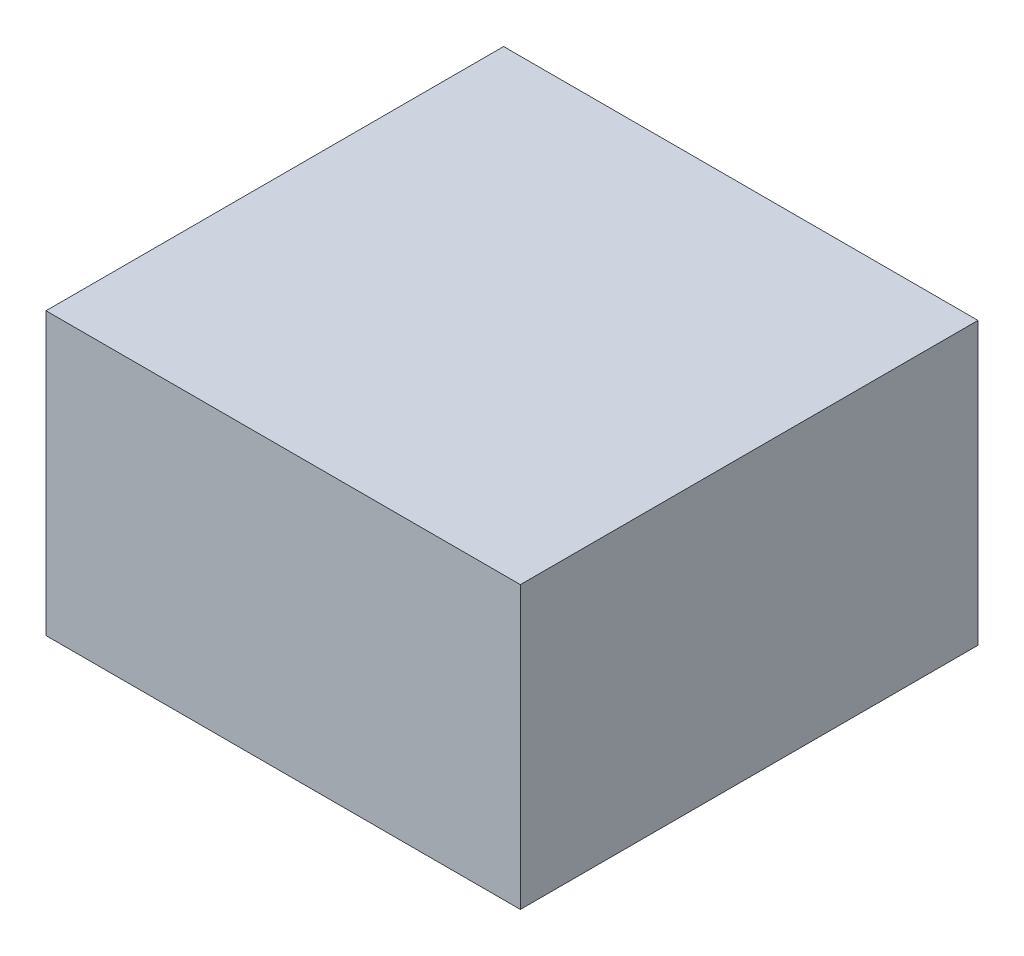
ISO-10303-21;
HEADER;
FILE_DESCRIPTION(('STEP AP214'),'2;1');
FILE_NAME('part.step','',(''),(''),'','','');
FILE_SCHEMA(('AUTOMOTIVE_DESIGN { 1 0 10303 214 1 1 1 1 }'));
ENDSEC;
DATA;
#1=APPLICATION_CONTEXT('core data for automotive mechanical design processes');
#2=APPLICATION_PROTOCOL_DEFINITION('international standard','automotive_design',2000,#1);
#3=PRODUCT_CONTEXT('',#1,'mechanical');
#4=PRODUCT('Part','Part','',(#3));
#5=PRODUCT_RELATED_PRODUCT_CATEGORY('part','',(#4));
#6=PRODUCT_DEFINITION_FORMATION('','',#4);
#7=PRODUCT_DEFINITION_CONTEXT('part definition',#1,'design');
#8=PRODUCT_DEFINITION('design','',#6,#7);
#9=PRODUCT_DEFINITION_SHAPE('','',#8);
#10=(LENGTH_UNIT() NAMED_UNIT(*) SI_UNIT(.MILLI.,.METRE.));
#11=(NAMED_UNIT(*) PLANE_ANGLE_UNIT() SI_UNIT($,.RADIAN.));
#12=(NAMED_UNIT(*) SI_UNIT($,.STERADIAN.) SOLID_ANGLE_UNIT());
#13=UNCERTAINTY_MEASURE_WITH_UNIT(LENGTH_MEASURE(1.E-05),#10,'distance_accuracy_value','');
#14=(GEOMETRIC_REPRESENTATION_CONTEXT(3) GLOBAL_UNCERTAINTY_ASSIGNED_CONTEXT((#13)) GLOBAL_UNIT_ASSIGNED_CONTEXT((#10,
#11,#12)) REPRESENTATION_CONTEXT('',''));
#15=CARTESIAN_POINT('',(0.,0.,0.));
#16=DIRECTION('',(0.,0.,1.));
#17=DIRECTION('',(1.,0.,0.));
#18=AXIS2_PLACEMENT_3D('',#15,#16,#17);
#19=CARTESIAN_POINT('',(-212.5,3.175,-205.));
#20=DIRECTION('',(1.,0.,0.));
#21=DIRECTION('',(0.,0.,-1.));
#22=AXIS2_PLACEMENT_3D('',#19,#20,#21);
#23=PLANE('',#22);
#24=DIRECTION('',(0.,-1.,0.));
#25=VECTOR('',#24,1.);
#26=CARTESIAN_POINT('',(-212.5,3.17500000000004,73.4000000000001));
#27=LINE('',#26,#25);
#28=CARTESIAN_POINT('',(-212.5,232.061,73.4));
#29=VERTEX_POINT('',#28);
#30=CARTESIAN_POINT('',(-212.5,132.061,73.4));
#31=VERTEX_POINT('',#30);
#32=EDGE_CURVE('E467',#29,#31,#27,.T.);
#33=ORIENTED_EDGE('',*,*,#32,.F.);
#34=DIRECTION('',(0.,0.,-1.));
#35=VECTOR('',#34,1.);
#36=CARTESIAN_POINT('',(-212.5,232.061,-205.));
#37=LINE('',#36,#35);
#38=CARTESIAN_POINT('',(-212.5,232.061,135.4));
#39=VERTEX_POINT('',#38);
#40=EDGE_CURVE('E457',#39,#29,#37,.T.);
#41=ORIENTED_EDGE('',*,*,#40,.F.);
#42=DIRECTION('',(0.,1.,0.));
#43=VECTOR('',#42,1.);
#44=CARTESIAN_POINT('',(-212.5,3.175,135.4));
#45=LINE('',#44,#43);
#46=CARTESIAN_POINT('',(-212.5,132.061,135.4));
#47=VERTEX_POINT('',#46);
#48=EDGE_CURVE('E461',#47,#39,#45,.T.);
#49=ORIENTED_EDGE('',*,*,#48,.F.);
#50=DIRECTION('',(0.,0.,1.));
#51=VECTOR('',#50,1.);
#52=CARTESIAN_POINT('',(-212.5,132.061,-205.));
#53=LINE('',#52,#51);
#54=EDGE_CURVE('E464',#31,#47,#53,.T.);
#55=ORIENTED_EDGE('',*,*,#54,.F.);
#56=EDGE_LOOP('',(#33,#41,#49,#55));
#57=FACE_BOUND('',#56,.T.);
#58=DIRECTION('',(0.,-1.,0.));
#59=VECTOR('',#58,1.);
#60=CARTESIAN_POINT('',(-212.5,3.17500000000002,-65.7999999999999));
#61=LINE('',#60,#59);
#62=CARTESIAN_POINT('',(-212.5,232.061,-65.8));
#63=VERTEX_POINT('',#62);
#64=CARTESIAN_POINT('',(-212.5,132.061,-65.8));
#65=VERTEX_POINT('',#64);
#66=EDGE_CURVE('E441',#63,#65,#61,.T.);
#67=ORIENTED_EDGE('',*,*,#66,.F.);
#68=DIRECTION('',(0.,0.,-1.));
#69=VECTOR('',#68,1.);
#70=CARTESIAN_POINT('',(-212.5,232.061,-205.));
#71=LINE('',#70,#69);
#72=CARTESIAN_POINT('',(-212.5,232.061,-3.79999999999994));
#73=VERTEX_POINT('',#72);
#74=EDGE_CURVE('E431',#73,#63,#71,.T.);
#75=ORIENTED_EDGE('',*,*,#74,.F.);
#76=DIRECTION('',(0.,1.,0.));
#77=VECTOR('',#76,1.);
#78=CARTESIAN_POINT('',(-212.5,3.17500000000002,-3.79999999999991));
#79=LINE('',#78,#77);
#80=CARTESIAN_POINT('',(-212.5,132.061,-3.79999999999993));
#81=VERTEX_POINT('',#80);
#82=EDGE_CURVE('E435',#81,#73,#79,.T.);
#83=ORIENTED_EDGE('',*,*,#82,.F.);
#84=DIRECTION('',(0.,0.,1.));
#85=VECTOR('',#84,1.);
#86=CARTESIAN_POINT('',(-212.5,132.061,-205.));
#87=LINE('',#86,#85);
#88=EDGE_CURVE('E438',#65,#81,#87,.T.);
#89=ORIENTED_EDGE('',*,*,#88,.F.);
#90=EDGE_LOOP('',(#67,#75,#83,#89));
#91=FACE_BOUND('',#90,.T.);
#92=DIRECTION('',(0.,-1.,0.));
#93=VECTOR('',#92,1.);
#94=CARTESIAN_POINT('',(-212.5,3.175,-135.4));
#95=LINE('',#94,#93);
#96=CARTESIAN_POINT('',(-212.5,232.061,-135.4));
#97=VERTEX_POINT('',#96);
#98=CARTESIAN_POINT('',(-212.5,132.061,-135.4));
#99=VERTEX_POINT('',#98);
#100=EDGE_CURVE('E428',#97,#99,#95,.T.);
#101=ORIENTED_EDGE('',*,*,#100,.F.);
#102=DIRECTION('',(0.,0.,-1.));
#103=VECTOR('',#102,1.);
#104=CARTESIAN_POINT('',(-212.5,232.061,-205.));
#105=LINE('',#104,#103);
#106=CARTESIAN_POINT('',(-212.5,232.061,-73.3999999999999));
#107=VERTEX_POINT('',#106);
#108=EDGE_CURVE('E418',#107,#97,#105,.T.);
#109=ORIENTED_EDGE('',*,*,#108,.F.);
#110=DIRECTION('',(0.,1.,0.));
#111=VECTOR('',#110,1.);
#112=CARTESIAN_POINT('',(-212.5,3.17500000000002,-73.3999999999999));
#113=LINE('',#112,#111);
#114=CARTESIAN_POINT('',(-212.5,132.061,-73.3999999999999));
#115=VERTEX_POINT('',#114);
#116=EDGE_CURVE('E422',#115,#107,#113,.T.);
#117=ORIENTED_EDGE('',*,*,#116,.F.);
#118=DIRECTION('',(0.,0.,1.));
#119=VECTOR('',#118,1.);
#120=CARTESIAN_POINT('',(-212.5,132.061,-205.));
#121=LINE('',#120,#119);
#122=EDGE_CURVE('E425',#99,#115,#121,.T.);
#123=ORIENTED_EDGE('',*,*,#122,.F.);
#124=EDGE_LOOP('',(#101,#109,#117,#123));
#125=FACE_BOUND('',#124,.T.);
#126=DIRECTION('',(0.,-1.,0.));
#127=VECTOR('',#126,1.);
#128=CARTESIAN_POINT('',(-212.5,3.17500000000003,3.80000000000008));
#129=LINE('',#128,#127);
#130=CARTESIAN_POINT('',(-212.5,232.061,3.8));
#131=VERTEX_POINT('',#130);
#132=CARTESIAN_POINT('',(-212.5,132.061,3.80000000000003));
#133=VERTEX_POINT('',#132);
#134=EDGE_CURVE('E454',#131,#133,#129,.T.);
#135=ORIENTED_EDGE('',*,*,#134,.F.);
#136=DIRECTION('',(0.,0.,-1.));
#137=VECTOR('',#136,1.);
#138=CARTESIAN_POINT('',(-212.5,232.061,-205.));
#139=LINE('',#138,#137);
#140=CARTESIAN_POINT('',(-212.5,232.061,65.8000000000001));
#141=VERTEX_POINT('',#140);
#142=EDGE_CURVE('E444',#141,#131,#139,.T.);
#143=ORIENTED_EDGE('',*,*,#142,.F.);
#144=DIRECTION('',(0.,1.,0.));
#145=VECTOR('',#144,1.);
#146=CARTESIAN_POINT('',(-212.5,3.17500000000004,65.8000000000001));
#147=LINE('',#146,#145);
#148=CARTESIAN_POINT('',(-212.5,132.061,65.8000000000001));
#149=VERTEX_POINT('',#148);
#150=EDGE_CURVE('E448',#149,#141,#147,.T.);
#151=ORIENTED_EDGE('',*,*,#150,.F.);
#152=DIRECTION('',(0.,0.,1.));
#153=VECTOR('',#152,1.);
#154=CARTESIAN_POINT('',(-212.5,132.061,-205.));
#155=LINE('',#154,#153);
#156=EDGE_CURVE('E451',#133,#149,#155,.T.);
#157=ORIENTED_EDGE('',*,*,#156,.F.);
#158=EDGE_LOOP('',(#135,#143,#151,#157));
#159=FACE_BOUND('',#158,.T.);
#160=DIRECTION('',(0.,0.,1.));
#161=VECTOR('',#160,1.);
#162=CARTESIAN_POINT('',(-212.5,132.061,-205.));
#163=LINE('',#162,#161);
#164=CARTESIAN_POINT('',(-212.5,132.061,143.));
#165=VERTEX_POINT('',#164);
#166=CARTESIAN_POINT('',(-212.5,132.061,205.));
#167=VERTEX_POINT('',#166);
#168=EDGE_CURVE('E11',#165,#167,#163,.T.);
#169=ORIENTED_EDGE('',*,*,#168,.F.);
#170=DIRECTION('',(0.,-1.,0.));
#171=VECTOR('',#170,1.);
#172=CARTESIAN_POINT('',(-212.5,3.175,143.));
#173=LINE('',#172,#171);
#174=CARTESIAN_POINT('',(-212.5,232.061,143.));
#175=VERTEX_POINT('',#174);
#176=EDGE_CURVE('E49',#175,#165,#173,.T.);
#177=ORIENTED_EDGE('',*,*,#176,.F.);
#178=DIRECTION('',(0.,0.,-1.));
#179=VECTOR('',#178,1.);
#180=CARTESIAN_POINT('',(-212.5,232.061,-205.));
#181=LINE('',#180,#179);
#182=CARTESIAN_POINT('',(-212.5,232.061,205.));
#183=VERTEX_POINT('',#182);
#184=EDGE_CURVE('E470',#183,#175,#181,.T.);
#185=ORIENTED_EDGE('',*,*,#184,.F.);
#186=DIRECTION('',(0.,-1.,0.));
#187=VECTOR('',#186,1.);
#188=CARTESIAN_POINT('',(-212.5,3.175,205.));
#189=LINE('',#188,#187);
#190=CARTESIAN_POINT('',(-212.5,252.061,205.));
#191=VERTEX_POINT('',#190);
#192=EDGE_CURVE('E263',#191,#183,#189,.T.);
#193=ORIENTED_EDGE('',*,*,#192,.F.);
#194=DIRECTION('',(0.,0.,1.));
#195=VECTOR('',#194,1.);
#196=CARTESIAN_POINT('',(-212.5,252.061,-205.));
#197=LINE('',#196,#195);
#198=CARTESIAN_POINT('',(-212.5,252.061,-205.));
#199=VERTEX_POINT('',#198);
#200=EDGE_CURVE('E261',#199,#191,#197,.T.);
#201=ORIENTED_EDGE('',*,*,#200,.F.);
#202=DIRECTION('',(0.,-1.,0.));
#203=VECTOR('',#202,1.);
#204=CARTESIAN_POINT('',(-212.5,3.175,-205.));
#205=LINE('',#204,#203);
#206=CARTESIAN_POINT('',(-212.5,232.061,-205.));
#207=VERTEX_POINT('',#206);
#208=EDGE_CURVE('E246',#199,#207,#205,.T.);
#209=ORIENTED_EDGE('',*,*,#208,.T.);
#210=DIRECTION('',(0.,0.,-1.));
#211=VECTOR('',#210,1.);
#212=CARTESIAN_POINT('',(-212.5,232.061,-205.));
#213=LINE('',#212,#211);
#214=CARTESIAN_POINT('',(-212.5,232.061,-143.));
#215=VERTEX_POINT('',#214);
#216=EDGE_CURVE('E409',#215,#207,#213,.T.);
#217=ORIENTED_EDGE('',*,*,#216,.F.);
#218=DIRECTION('',(0.,1.,0.));
#219=VECTOR('',#218,1.);
#220=CARTESIAN_POINT('',(-212.5,3.17499999999998,-143.));
#221=LINE('',#220,#219);
#222=CARTESIAN_POINT('',(-212.5,132.061,-143.));
#223=VERTEX_POINT('',#222);
#224=EDGE_CURVE('E412',#223,#215,#221,.T.);
#225=ORIENTED_EDGE('',*,*,#224,.F.);
#226=DIRECTION('',(0.,0.,1.));
#227=VECTOR('',#226,1.);
#228=CARTESIAN_POINT('',(-212.5,132.061,-205.));
#229=LINE('',#228,#227);
#230=CARTESIAN_POINT('',(-212.5,132.061,-205.));
#231=VERTEX_POINT('',#230);
#232=EDGE_CURVE('E415',#231,#223,#229,.T.);
#233=ORIENTED_EDGE('',*,*,#232,.F.);
#234=CARTESIAN_POINT('',(-212.5,0.,-205.));
#235=VERTEX_POINT('',#234);
#236=EDGE_CURVE('E259',#231,#235,#205,.T.);
#237=ORIENTED_EDGE('',*,*,#236,.T.);
#238=DIRECTION('',(0.,0.,1.));
#239=VECTOR('',#238,1.);
#240=CARTESIAN_POINT('',(-212.5,0.,-205.));
#241=LINE('',#240,#239);
#242=CARTESIAN_POINT('',(-212.5,0.,205.));
#243=VERTEX_POINT('',#242);
#244=EDGE_CURVE('E397',#235,#243,#241,.T.);
#245=ORIENTED_EDGE('',*,*,#244,.T.);
#246=EDGE_CURVE('E405',#167,#243,#189,.T.);
#247=ORIENTED_EDGE('',*,*,#246,.F.);
#248=EDGE_LOOP('',(#169,#177,#185,#193,#201,#209,#217,#225,#233,#237,#245,#247));
#249=FACE_BOUND('',#248,.T.);
#250=ADVANCED_FACE('F39',(#57,#91,#125,#159,#249),#23,.F.);
#251=ORIENTED_EDGE('',*,*,#176,.T.);
#252=ORIENTED_EDGE('',*,*,#168,.T.);
#253=EDGE_CURVE('E406',#183,#167,#189,.T.);
#254=ORIENTED_EDGE('',*,*,#253,.F.);
#255=ORIENTED_EDGE('',*,*,#184,.T.);
#256=EDGE_LOOP('',(#251,#252,#254,#255));
#257=FACE_BOUND('',#256,.T.);
#258=ADVANCED_FACE('F476',(#257),#23,.F.);
#259=ORIENTED_EDGE('',*,*,#40,.T.);
#260=ORIENTED_EDGE('',*,*,#32,.T.);
#261=ORIENTED_EDGE('',*,*,#54,.T.);
#262=ORIENTED_EDGE('',*,*,#48,.T.);
#263=EDGE_LOOP('',(#259,#260,#261,#262));
#264=FACE_BOUND('',#263,.T.);
#265=ADVANCED_FACE('F520',(#264),#23,.F.);
#266=ORIENTED_EDGE('',*,*,#142,.T.);
#267=ORIENTED_EDGE('',*,*,#134,.T.);
#268=ORIENTED_EDGE('',*,*,#156,.T.);
#269=ORIENTED_EDGE('',*,*,#150,.T.);
#270=EDGE_LOOP('',(#266,#267,#268,#269));
#271=FACE_BOUND('',#270,.T.);
#272=ADVANCED_FACE('F508',(#271),#23,.F.);
#273=ORIENTED_EDGE('',*,*,#74,.T.);
#274=ORIENTED_EDGE('',*,*,#66,.T.);
#275=ORIENTED_EDGE('',*,*,#88,.T.);
#276=ORIENTED_EDGE('',*,*,#82,.T.);
#277=EDGE_LOOP('',(#273,#274,#275,#276));
#278=FACE_BOUND('',#277,.T.);
#279=ADVANCED_FACE('F501',(#278),#23,.F.);
#280=ORIENTED_EDGE('',*,*,#108,.T.);
#281=ORIENTED_EDGE('',*,*,#100,.T.);
#282=ORIENTED_EDGE('',*,*,#122,.T.);
#283=ORIENTED_EDGE('',*,*,#116,.T.);
#284=EDGE_LOOP('',(#280,#281,#282,#283));
#285=FACE_BOUND('',#284,.T.);
#286=ADVANCED_FACE('F492',(#285),#23,.F.);
#287=CARTESIAN_POINT('',(0.,252.061,0.));
#288=DIRECTION('',(0.,1.,0.));
#289=DIRECTION('',(0.,0.,1.));
#290=AXIS2_PLACEMENT_3D('',#287,#288,#289);
#291=PLANE('',#290);
#292=DIRECTION('',(-1.,0.,0.));
#293=VECTOR('',#292,1.);
#294=CARTESIAN_POINT('',(212.5,252.061,-205.));
#295=LINE('',#294,#293);
#296=CARTESIAN_POINT('',(212.5,252.061,-205.));
#297=VERTEX_POINT('',#296);
#298=EDGE_CURVE('E252',#297,#199,#295,.T.);
#299=ORIENTED_EDGE('',*,*,#298,.T.);
#300=ORIENTED_EDGE('',*,*,#200,.T.);
#301=DIRECTION('',(1.,0.,0.));
#302=VECTOR('',#301,1.);
#303=CARTESIAN_POINT('',(-212.5,252.061,205.));
#304=LINE('',#303,#302);
#305=CARTESIAN_POINT('',(212.5,252.061,205.));
#306=VERTEX_POINT('',#305);
#307=EDGE_CURVE('E267',#191,#306,#304,.T.);
#308=ORIENTED_EDGE('',*,*,#307,.T.);
#309=DIRECTION('',(0.,0.,-1.));
#310=VECTOR('',#309,1.);
#311=CARTESIAN_POINT('',(212.5,252.061,205.));
#312=LINE('',#311,#310);
#313=EDGE_CURVE('E272',#306,#297,#312,.T.);
#314=ORIENTED_EDGE('',*,*,#313,.T.);
#315=EDGE_LOOP('',(#299,#300,#308,#314));
#316=FACE_BOUND('',#315,.T.);
#317=ADVANCED_FACE('F270',(#316),#291,.T.);
#318=CARTESIAN_POINT('',(0.,0.,0.));
#319=DIRECTION('',(0.,1.,0.));
#320=DIRECTION('',(0.,0.,1.));
#321=AXIS2_PLACEMENT_3D('',#318,#319,#320);
#322=PLANE('',#321);
#323=DIRECTION('',(0.,0.,-1.));
#324=VECTOR('',#323,1.);
#325=CARTESIAN_POINT('',(212.5,0.,-205.));
#326=LINE('',#325,#324);
#327=CARTESIAN_POINT('',(212.5,0.,205.));
#328=VERTEX_POINT('',#327);
#329=CARTESIAN_POINT('',(212.5,0.,-205.));
#330=VERTEX_POINT('',#329);
#331=EDGE_CURVE('E358',#328,#330,#326,.T.);
#332=ORIENTED_EDGE('',*,*,#331,.F.);
#333=DIRECTION('',(1.,0.,0.));
#334=VECTOR('',#333,1.);
#335=CARTESIAN_POINT('',(-212.5,0.,205.));
#336=LINE('',#335,#334);
#337=EDGE_CURVE('E400',#243,#328,#336,.T.);
#338=ORIENTED_EDGE('',*,*,#337,.F.);
#339=ORIENTED_EDGE('',*,*,#244,.F.);
#340=DIRECTION('',(-1.,0.,0.));
#341=VECTOR('',#340,1.);
#342=CARTESIAN_POINT('',(-212.5,0.,-205.));
#343=LINE('',#342,#341);
#344=EDGE_CURVE('E395',#330,#235,#343,.T.);
#345=ORIENTED_EDGE('',*,*,#344,.F.);
#346=EDGE_LOOP('',(#332,#338,#339,#345));
#347=FACE_BOUND('',#346,.T.);
#348=ADVANCED_FACE('F486',(#347),#322,.F.);
#349=CARTESIAN_POINT('',(212.5,3.175,-205.));
#350=DIRECTION('',(-1.,0.,0.));
#351=DIRECTION('',(0.,0.,1.));
#352=AXIS2_PLACEMENT_3D('',#349,#350,#351);
#353=PLANE('',#352);
#354=ORIENTED_EDGE('',*,*,#331,.T.);
#355=DIRECTION('',(0.,-1.,0.));
#356=VECTOR('',#355,1.);
#357=CARTESIAN_POINT('',(212.5,3.175,-205.));
#358=LINE('',#357,#356);
#359=EDGE_CURVE('E257',#297,#330,#358,.T.);
#360=ORIENTED_EDGE('',*,*,#359,.F.);
#361=ORIENTED_EDGE('',*,*,#313,.F.);
#362=DIRECTION('',(0.,-1.,0.));
#363=VECTOR('',#362,1.);
#364=CARTESIAN_POINT('',(212.5,3.175,205.));
#365=LINE('',#364,#363);
#366=EDGE_CURVE('E402',#306,#328,#365,.T.);
#367=ORIENTED_EDGE('',*,*,#366,.T.);
#368=EDGE_LOOP('',(#354,#360,#361,#367));
#369=FACE_BOUND('',#368,.T.);
#370=ADVANCED_FACE('F41',(#369),#353,.F.);
#371=CARTESIAN_POINT('',(-212.5,3.175,205.));
#372=DIRECTION('',(0.,0.,-1.));
#373=DIRECTION('',(-1.,0.,0.));
#374=AXIS2_PLACEMENT_3D('',#371,#372,#373);
#375=PLANE('',#374);
#376=ORIENTED_EDGE('',*,*,#337,.T.);
#377=ORIENTED_EDGE('',*,*,#366,.F.);
#378=ORIENTED_EDGE('',*,*,#307,.F.);
#379=ORIENTED_EDGE('',*,*,#192,.T.);
#380=ORIENTED_EDGE('',*,*,#253,.T.);
#381=ORIENTED_EDGE('',*,*,#246,.T.);
#382=EDGE_LOOP('',(#376,#377,#378,#379,#380,#381));
#383=FACE_BOUND('',#382,.T.);
#384=ADVANCED_FACE('F480',(#383),#375,.F.);
#385=EDGE_CURVE('E255',#207,#231,#205,.T.);
#386=ORIENTED_EDGE('',*,*,#385,.T.);
#387=ORIENTED_EDGE('',*,*,#232,.T.);
#388=ORIENTED_EDGE('',*,*,#224,.T.);
#389=ORIENTED_EDGE('',*,*,#216,.T.);
#390=EDGE_LOOP('',(#386,#387,#388,#389));
#391=FACE_BOUND('',#390,.T.);
#392=ADVANCED_FACE('F489',(#391),#23,.F.);
#393=CARTESIAN_POINT('',(-212.5,3.175,-205.));
#394=DIRECTION('',(0.,0.,1.));
#395=DIRECTION('',(1.,0.,0.));
#396=AXIS2_PLACEMENT_3D('',#393,#394,#395);
#397=PLANE('',#396);
#398=ORIENTED_EDGE('',*,*,#344,.T.);
#399=ORIENTED_EDGE('',*,*,#236,.F.);
#400=ORIENTED_EDGE('',*,*,#385,.F.);
#401=ORIENTED_EDGE('',*,*,#208,.F.);
#402=ORIENTED_EDGE('',*,*,#298,.F.);
#403=ORIENTED_EDGE('',*,*,#359,.T.);
#404=EDGE_LOOP('',(#398,#399,#400,#401,#402,#403));
#405=FACE_BOUND('',#404,.T.);
#406=ADVANCED_FACE('F249',(#405),#397,.F.);
#407=CLOSED_SHELL('',(#250,#258,#265,#272,#279,#286,#317,#348,#370,#384,#392,#406));
#408=CARTESIAN_POINT('',(0.,3.175,0.));
#409=DIRECTION('',(0.,1.,0.));
#410=DIRECTION('',(0.,0.,1.));
#411=AXIS2_PLACEMENT_3D('',#408,#409,#410);
#412=PLANE('',#411);
#413=DIRECTION('',(0.,0.,-1.));
#414=VECTOR('',#413,1.);
#415=CARTESIAN_POINT('',(210.214,3.175,0.));
#416=LINE('',#415,#414);
#417=CARTESIAN_POINT('',(210.214,3.175,-1.143));
#418=VERTEX_POINT('',#417);
#419=CARTESIAN_POINT('',(210.214,3.175,-202.714));
#420=VERTEX_POINT('',#419);
#421=EDGE_CURVE('E328',#418,#420,#416,.T.);
#422=ORIENTED_EDGE('',*,*,#421,.T.);
#423=DIRECTION('',(-1.,0.,0.));
#424=VECTOR('',#423,1.);
#425=CARTESIAN_POINT('',(0.,3.175,-202.714));
#426=LINE('',#425,#424);
#427=CARTESIAN_POINT('',(1.14300000000003,3.175,-202.714));
#428=VERTEX_POINT('',#427);
#429=EDGE_CURVE('E331',#420,#428,#426,.T.);
#430=ORIENTED_EDGE('',*,*,#429,.T.);
#431=DIRECTION('',(0.,0.,1.));
#432=VECTOR('',#431,1.);
#433=CARTESIAN_POINT('',(1.14300000000003,3.175,0.));
#434=LINE('',#433,#432);
#435=CARTESIAN_POINT('',(1.14300000000003,3.175,-1.143));
#436=VERTEX_POINT('',#435);
#437=EDGE_CURVE('E341',#428,#436,#434,.T.);
#438=ORIENTED_EDGE('',*,*,#437,.T.);
#439=DIRECTION('',(1.,0.,0.));
#440=VECTOR('',#439,1.);
#441=CARTESIAN_POINT('',(0.,3.175,-1.143));
#442=LINE('',#441,#440);
#443=EDGE_CURVE('E339',#436,#418,#442,.T.);
#444=ORIENTED_EDGE('',*,*,#443,.T.);
#445=EDGE_LOOP('',(#422,#430,#438,#444));
#446=FACE_BOUND('',#445,.T.);
#447=ADVANCED_FACE('F752',(#446),#412,.T.);
#448=CARTESIAN_POINT('',(0.,249.775,-202.714));
#449=DIRECTION('',(0.,0.,1.));
#450=DIRECTION('',(1.,0.,0.));
#451=AXIS2_PLACEMENT_3D('',#448,#449,#450);
#452=PLANE('',#451);
#453=ORIENTED_EDGE('',*,*,#429,.F.);
#454=DIRECTION('',(0.,-1.,0.));
#455=VECTOR('',#454,1.);
#456=CARTESIAN_POINT('',(210.214,249.775,-202.714));
#457=LINE('',#456,#455);
#458=CARTESIAN_POINT('',(210.214,249.775,-202.714));
#459=VERTEX_POINT('',#458);
#460=EDGE_CURVE('E359',#459,#420,#457,.T.);
#461=ORIENTED_EDGE('',*,*,#460,.F.);
#462=DIRECTION('',(-1.,0.,0.));
#463=VECTOR('',#462,1.);
#464=CARTESIAN_POINT('',(0.,249.775,-202.714));
#465=LINE('',#464,#463);
#466=CARTESIAN_POINT('',(1.14300000000003,249.775,-202.714));
#467=VERTEX_POINT('',#466);
#468=EDGE_CURVE('E296',#459,#467,#465,.T.);
#469=ORIENTED_EDGE('',*,*,#468,.T.);
#470=DIRECTION('',(0.,-1.,0.));
#471=VECTOR('',#470,1.);
#472=CARTESIAN_POINT('',(1.14300000000003,249.775,-202.714));
#473=LINE('',#472,#471);
#474=EDGE_CURVE('E362',#467,#428,#473,.T.);
#475=ORIENTED_EDGE('',*,*,#474,.T.);
#476=EDGE_LOOP('',(#453,#461,#469,#475));
#477=FACE_BOUND('',#476,.T.);
#478=ADVANCED_FACE('F682',(#477),#452,.T.);
#479=CARTESIAN_POINT('',(1.14300000000003,249.775,0.));
#480=DIRECTION('',(1.,0.,0.));
#481=DIRECTION('',(0.,0.,-1.));
#482=AXIS2_PLACEMENT_3D('',#479,#480,#481);
#483=PLANE('',#482);
#484=ORIENTED_EDGE('',*,*,#437,.F.);
#485=ORIENTED_EDGE('',*,*,#474,.F.);
#486=DIRECTION('',(0.,0.,1.));
#487=VECTOR('',#486,1.);
#488=CARTESIAN_POINT('',(1.14300000000003,249.775,0.));
#489=LINE('',#488,#487);
#490=CARTESIAN_POINT('',(1.14300000000003,249.775,-1.143));
#491=VERTEX_POINT('',#490);
#492=EDGE_CURVE('E308',#467,#491,#489,.T.);
#493=ORIENTED_EDGE('',*,*,#492,.T.);
#494=DIRECTION('',(0.,-1.,0.));
#495=VECTOR('',#494,1.);
#496=CARTESIAN_POINT('',(1.14300000000003,249.775,-1.143));
#497=LINE('',#496,#495);
#498=EDGE_CURVE('E366',#491,#436,#497,.T.);
#499=ORIENTED_EDGE('',*,*,#498,.T.);
#500=EDGE_LOOP('',(#484,#485,#493,#499));
#501=FACE_BOUND('',#500,.T.);
#502=ADVANCED_FACE('F735',(#501),#483,.T.);
#503=CARTESIAN_POINT('',(0.,249.775,-1.143));
#504=DIRECTION('',(0.,0.,-1.));
#505=DIRECTION('',(-1.,0.,0.));
#506=AXIS2_PLACEMENT_3D('',#503,#504,#505);
#507=PLANE('',#506);
#508=ORIENTED_EDGE('',*,*,#443,.F.);
#509=ORIENTED_EDGE('',*,*,#498,.F.);
#510=DIRECTION('',(1.,0.,0.));
#511=VECTOR('',#510,1.);
#512=CARTESIAN_POINT('',(0.,249.775,-1.143));
#513=LINE('',#512,#511);
#514=CARTESIAN_POINT('',(210.214,249.775,-1.143));
#515=VERTEX_POINT('',#514);
#516=EDGE_CURVE('E305',#491,#515,#513,.T.);
#517=ORIENTED_EDGE('',*,*,#516,.T.);
#518=DIRECTION('',(0.,-1.,0.));
#519=VECTOR('',#518,1.);
#520=CARTESIAN_POINT('',(210.214,249.775,-1.143));
#521=LINE('',#520,#519);
#522=EDGE_CURVE('E351',#515,#418,#521,.T.);
#523=ORIENTED_EDGE('',*,*,#522,.T.);
#524=EDGE_LOOP('',(#508,#509,#517,#523));
#525=FACE_BOUND('',#524,.T.);
#526=ADVANCED_FACE('F726',(#525),#507,.T.);
#527=CARTESIAN_POINT('',(210.214,249.775,0.));
#528=DIRECTION('',(-1.,0.,0.));
#529=DIRECTION('',(0.,0.,1.));
#530=AXIS2_PLACEMENT_3D('',#527,#528,#529);
#531=PLANE('',#530);
#532=ORIENTED_EDGE('',*,*,#421,.F.);
#533=ORIENTED_EDGE('',*,*,#522,.F.);
#534=DIRECTION('',(0.,0.,-1.));
#535=VECTOR('',#534,1.);
#536=CARTESIAN_POINT('',(210.214,249.775,0.));
#537=LINE('',#536,#535);
#538=EDGE_CURVE('E292',#515,#459,#537,.T.);
#539=ORIENTED_EDGE('',*,*,#538,.T.);
#540=ORIENTED_EDGE('',*,*,#460,.T.);
#541=EDGE_LOOP('',(#532,#533,#539,#540));
#542=FACE_BOUND('',#541,.T.);
#543=ADVANCED_FACE('F657',(#542),#531,.T.);
#544=CARTESIAN_POINT('',(0.,249.775,0.));
#545=DIRECTION('',(0.,1.,0.));
#546=DIRECTION('',(0.,0.,1.));
#547=AXIS2_PLACEMENT_3D('',#544,#545,#546);
#548=PLANE('',#547);
#549=ORIENTED_EDGE('',*,*,#538,.F.);
#550=ORIENTED_EDGE('',*,*,#516,.F.);
#551=ORIENTED_EDGE('',*,*,#492,.F.);
#552=ORIENTED_EDGE('',*,*,#468,.F.);
#553=EDGE_LOOP('',(#549,#550,#551,#552));
#554=FACE_BOUND('',#553,.T.);
#555=ADVANCED_FACE('F556',(#554),#548,.F.);
#556=CLOSED_SHELL('',(#447,#478,#502,#526,#543,#555));
#557=CARTESIAN_POINT('',(-1.14299999999997,3.175,-202.714));
#558=VERTEX_POINT('',#557);
#559=CARTESIAN_POINT('',(-210.214,3.175,-202.714));
#560=VERTEX_POINT('',#559);
#561=EDGE_CURVE('E327',#558,#560,#426,.T.);
#562=ORIENTED_EDGE('',*,*,#561,.T.);
#563=DIRECTION('',(0.,0.,1.));
#564=VECTOR('',#563,1.);
#565=CARTESIAN_POINT('',(-210.214,3.175,0.));
#566=LINE('',#565,#564);
#567=CARTESIAN_POINT('',(-210.214,3.175,-1.143));
#568=VERTEX_POINT('',#567);
#569=EDGE_CURVE('E336',#560,#568,#566,.T.);
#570=ORIENTED_EDGE('',*,*,#569,.T.);
#571=DIRECTION('',(1.,0.,0.));
#572=VECTOR('',#571,1.);
#573=CARTESIAN_POINT('',(0.,3.175,-1.143));
#574=LINE('',#573,#572);
#575=CARTESIAN_POINT('',(-1.14299999999997,3.175,-1.143));
#576=VERTEX_POINT('',#575);
#577=EDGE_CURVE('E334',#568,#576,#574,.T.);
#578=ORIENTED_EDGE('',*,*,#577,.T.);
#579=DIRECTION('',(0.,0.,1.));
#580=VECTOR('',#579,1.);
#581=CARTESIAN_POINT('',(-1.14299999999997,3.175,0.));
#582=LINE('',#581,#580);
#583=EDGE_CURVE('E330',#558,#576,#582,.T.);
#584=ORIENTED_EDGE('',*,*,#583,.F.);
#585=EDGE_LOOP('',(#562,#570,#578,#584));
#586=FACE_BOUND('',#585,.T.);
#587=ADVANCED_FACE('F708',(#586),#412,.T.);
#588=CARTESIAN_POINT('',(-210.214,249.775,0.));
#589=DIRECTION('',(1.,0.,0.));
#590=DIRECTION('',(0.,0.,-1.));
#591=AXIS2_PLACEMENT_3D('',#588,#589,#590);
#592=PLANE('',#591);
#593=ORIENTED_EDGE('',*,*,#569,.F.);
#594=DIRECTION('',(0.,-1.,0.));
#595=VECTOR('',#594,1.);
#596=CARTESIAN_POINT('',(-210.214,249.775,-202.714));
#597=LINE('',#596,#595);
#598=CARTESIAN_POINT('',(-210.214,249.775,-202.714));
#599=VERTEX_POINT('',#598);
#600=EDGE_CURVE('E371',#599,#560,#597,.T.);
#601=ORIENTED_EDGE('',*,*,#600,.F.);
#602=DIRECTION('',(0.,0.,1.));
#603=VECTOR('',#602,1.);
#604=CARTESIAN_POINT('',(-210.214,249.775,0.));
#605=LINE('',#604,#603);
#606=CARTESIAN_POINT('',(-210.214,249.775,-1.143));
#607=VERTEX_POINT('',#606);
#608=EDGE_CURVE('E301',#599,#607,#605,.T.);
#609=ORIENTED_EDGE('',*,*,#608,.T.);
#610=DIRECTION('',(0.,-1.,0.));
#611=VECTOR('',#610,1.);
#612=CARTESIAN_POINT('',(-210.214,249.775,-1.143));
#613=LINE('',#612,#611);
#614=EDGE_CURVE('E374',#607,#568,#613,.T.);
#615=ORIENTED_EDGE('',*,*,#614,.T.);
#616=EDGE_LOOP('',(#593,#601,#609,#615));
#617=FACE_BOUND('',#616,.T.);
#618=ADVANCED_FACE('F584',(#617),#592,.T.);
#619=CARTESIAN_POINT('',(0.,249.775,-1.143));
#620=DIRECTION('',(0.,0.,-1.));
#621=DIRECTION('',(-1.,0.,0.));
#622=AXIS2_PLACEMENT_3D('',#619,#620,#621);
#623=PLANE('',#622);
#624=ORIENTED_EDGE('',*,*,#577,.F.);
#625=ORIENTED_EDGE('',*,*,#614,.F.);
#626=DIRECTION('',(1.,0.,0.));
#627=VECTOR('',#626,1.);
#628=CARTESIAN_POINT('',(0.,249.775,-1.143));
#629=LINE('',#628,#627);
#630=CARTESIAN_POINT('',(-1.14299999999997,249.775,-1.143));
#631=VERTEX_POINT('',#630);
#632=EDGE_CURVE('E298',#607,#631,#629,.T.);
#633=ORIENTED_EDGE('',*,*,#632,.T.);
#634=DIRECTION('',(0.,-1.,0.));
#635=VECTOR('',#634,1.);
#636=CARTESIAN_POINT('',(-1.14299999999997,249.775,-1.143));
#637=LINE('',#636,#635);
#638=EDGE_CURVE('E378',#631,#576,#637,.T.);
#639=ORIENTED_EDGE('',*,*,#638,.T.);
#640=EDGE_LOOP('',(#624,#625,#633,#639));
#641=FACE_BOUND('',#640,.T.);
#642=ADVANCED_FACE('F691',(#641),#623,.T.);
#643=CARTESIAN_POINT('',(-1.14299999999997,249.775,0.));
#644=DIRECTION('',(1.,0.,0.));
#645=DIRECTION('',(0.,0.,-1.));
#646=AXIS2_PLACEMENT_3D('',#643,#644,#645);
#647=PLANE('',#646);
#648=ORIENTED_EDGE('',*,*,#583,.T.);
#649=ORIENTED_EDGE('',*,*,#638,.F.);
#650=DIRECTION('',(0.,0.,1.));
#651=VECTOR('',#650,1.);
#652=CARTESIAN_POINT('',(-1.14299999999997,249.775,0.));
#653=LINE('',#652,#651);
#654=CARTESIAN_POINT('',(-1.14299999999997,249.775,-202.714));
#655=VERTEX_POINT('',#654);
#656=EDGE_CURVE('E295',#655,#631,#653,.T.);
#657=ORIENTED_EDGE('',*,*,#656,.F.);
#658=DIRECTION('',(0.,-1.,0.));
#659=VECTOR('',#658,1.);
#660=CARTESIAN_POINT('',(-1.14299999999997,249.775,-202.714));
#661=LINE('',#660,#659);
#662=EDGE_CURVE('E363',#655,#558,#661,.T.);
#663=ORIENTED_EDGE('',*,*,#662,.T.);
#664=EDGE_LOOP('',(#648,#649,#657,#663));
#665=FACE_BOUND('',#664,.T.);
#666=ADVANCED_FACE('F679',(#665),#647,.F.);
#667=ORIENTED_EDGE('',*,*,#561,.F.);
#668=ORIENTED_EDGE('',*,*,#662,.F.);
#669=EDGE_CURVE('E291',#655,#599,#465,.T.);
#670=ORIENTED_EDGE('',*,*,#669,.T.);
#671=ORIENTED_EDGE('',*,*,#600,.T.);
#672=EDGE_LOOP('',(#667,#668,#670,#671));
#673=FACE_BOUND('',#672,.T.);
#674=ADVANCED_FACE('F667',(#673),#452,.T.);
#675=ORIENTED_EDGE('',*,*,#669,.F.);
#676=ORIENTED_EDGE('',*,*,#656,.T.);
#677=ORIENTED_EDGE('',*,*,#632,.F.);
#678=ORIENTED_EDGE('',*,*,#608,.F.);
#679=EDGE_LOOP('',(#675,#676,#677,#678));
#680=FACE_BOUND('',#679,.T.);
#681=ADVANCED_FACE('F615',(#680),#548,.F.);
#682=CLOSED_SHELL('',(#587,#618,#642,#666,#674,#681));
#683=DIRECTION('',(1.,0.,0.));
#684=VECTOR('',#683,1.);
#685=CARTESIAN_POINT('',(0.,3.175,202.714));
#686=LINE('',#685,#684);
#687=CARTESIAN_POINT('',(1.14300000000003,3.175,202.714));
#688=VERTEX_POINT('',#687);
#689=CARTESIAN_POINT('',(210.214,3.175,202.714));
#690=VERTEX_POINT('',#689);
#691=EDGE_CURVE('E277',#688,#690,#686,.T.);
#692=ORIENTED_EDGE('',*,*,#691,.T.);
#693=CARTESIAN_POINT('',(210.214,3.175,1.143));
#694=VERTEX_POINT('',#693);
#695=EDGE_CURVE('E325',#690,#694,#416,.T.);
#696=ORIENTED_EDGE('',*,*,#695,.T.);
#697=DIRECTION('',(1.,0.,0.));
#698=VECTOR('',#697,1.);
#699=CARTESIAN_POINT('',(0.,3.175,1.143));
#700=LINE('',#699,#698);
#701=CARTESIAN_POINT('',(1.14300000000003,3.175,1.143));
#702=VERTEX_POINT('',#701);
#703=EDGE_CURVE('E322',#702,#694,#700,.T.);
#704=ORIENTED_EDGE('',*,*,#703,.F.);
#705=DIRECTION('',(0.,0.,1.));
#706=VECTOR('',#705,1.);
#707=CARTESIAN_POINT('',(1.14300000000003,3.175,0.));
#708=LINE('',#707,#706);
#709=EDGE_CURVE('E319',#702,#688,#708,.T.);
#710=ORIENTED_EDGE('',*,*,#709,.T.);
#711=EDGE_LOOP('',(#692,#696,#704,#710));
#712=FACE_BOUND('',#711,.T.);
#713=ADVANCED_FACE('F654',(#712),#412,.T.);
#714=ORIENTED_EDGE('',*,*,#695,.F.);
#715=DIRECTION('',(0.,-1.,0.));
#716=VECTOR('',#715,1.);
#717=CARTESIAN_POINT('',(210.214,249.775,202.714));
#718=LINE('',#717,#716);
#719=CARTESIAN_POINT('',(210.214,249.775,202.714));
#720=VERTEX_POINT('',#719);
#721=EDGE_CURVE('E317',#720,#690,#718,.T.);
#722=ORIENTED_EDGE('',*,*,#721,.F.);
#723=CARTESIAN_POINT('',(210.214,249.775,1.143));
#724=VERTEX_POINT('',#723);
#725=EDGE_CURVE('E288',#720,#724,#537,.T.);
#726=ORIENTED_EDGE('',*,*,#725,.T.);
#727=DIRECTION('',(0.,-1.,0.));
#728=VECTOR('',#727,1.);
#729=CARTESIAN_POINT('',(210.214,249.775,1.143));
#730=LINE('',#729,#728);
#731=EDGE_CURVE('E385',#724,#694,#730,.T.);
#732=ORIENTED_EDGE('',*,*,#731,.T.);
#733=EDGE_LOOP('',(#714,#722,#726,#732));
#734=FACE_BOUND('',#733,.T.);
#735=ADVANCED_FACE('F644',(#734),#531,.T.);
#736=CARTESIAN_POINT('',(0.,249.775,1.143));
#737=DIRECTION('',(0.,0.,-1.));
#738=DIRECTION('',(-1.,0.,0.));
#739=AXIS2_PLACEMENT_3D('',#736,#737,#738);
#740=PLANE('',#739);
#741=ORIENTED_EDGE('',*,*,#703,.T.);
#742=ORIENTED_EDGE('',*,*,#731,.F.);
#743=DIRECTION('',(1.,0.,0.));
#744=VECTOR('',#743,1.);
#745=CARTESIAN_POINT('',(0.,249.775,1.143));
#746=LINE('',#745,#744);
#747=CARTESIAN_POINT('',(1.14300000000003,249.775,1.143));
#748=VERTEX_POINT('',#747);
#749=EDGE_CURVE('E286',#748,#724,#746,.T.);
#750=ORIENTED_EDGE('',*,*,#749,.F.);
#751=DIRECTION('',(0.,-1.,0.));
#752=VECTOR('',#751,1.);
#753=CARTESIAN_POINT('',(1.14300000000003,249.775,1.143));
#754=LINE('',#753,#752);
#755=EDGE_CURVE('E388',#748,#702,#754,.T.);
#756=ORIENTED_EDGE('',*,*,#755,.T.);
#757=EDGE_LOOP('',(#741,#742,#750,#756));
#758=FACE_BOUND('',#757,.T.);
#759=ADVANCED_FACE('F635',(#758),#740,.F.);
#760=CARTESIAN_POINT('',(1.14300000000003,249.775,0.));
#761=DIRECTION('',(1.,0.,0.));
#762=DIRECTION('',(0.,0.,-1.));
#763=AXIS2_PLACEMENT_3D('',#760,#761,#762);
#764=PLANE('',#763);
#765=ORIENTED_EDGE('',*,*,#709,.F.);
#766=ORIENTED_EDGE('',*,*,#755,.F.);
#767=DIRECTION('',(0.,0.,1.));
#768=VECTOR('',#767,1.);
#769=CARTESIAN_POINT('',(1.14300000000003,249.775,0.));
#770=LINE('',#769,#768);
#771=CARTESIAN_POINT('',(1.14300000000003,249.775,202.714));
#772=VERTEX_POINT('',#771);
#773=EDGE_CURVE('E281',#748,#772,#770,.T.);
#774=ORIENTED_EDGE('',*,*,#773,.T.);
#775=DIRECTION('',(0.,-1.,0.));
#776=VECTOR('',#775,1.);
#777=CARTESIAN_POINT('',(1.14300000000003,249.775,202.714));
#778=LINE('',#777,#776);
#779=EDGE_CURVE('E375',#772,#688,#778,.T.);
#780=ORIENTED_EDGE('',*,*,#779,.T.);
#781=EDGE_LOOP('',(#765,#766,#774,#780));
#782=FACE_BOUND('',#781,.T.);
#783=ADVANCED_FACE('F625',(#782),#764,.T.);
#784=CARTESIAN_POINT('',(0.,249.775,202.714));
#785=DIRECTION('',(0.,0.,-1.));
#786=DIRECTION('',(-1.,0.,0.));
#787=AXIS2_PLACEMENT_3D('',#784,#785,#786);
#788=PLANE('',#787);
#789=ORIENTED_EDGE('',*,*,#691,.F.);
#790=ORIENTED_EDGE('',*,*,#779,.F.);
#791=DIRECTION('',(1.,0.,0.));
#792=VECTOR('',#791,1.);
#793=CARTESIAN_POINT('',(0.,249.775,202.714));
#794=LINE('',#793,#792);
#795=EDGE_CURVE('E278',#772,#720,#794,.T.);
#796=ORIENTED_EDGE('',*,*,#795,.T.);
#797=ORIENTED_EDGE('',*,*,#721,.T.);
#798=EDGE_LOOP('',(#789,#790,#796,#797));
#799=FACE_BOUND('',#798,.T.);
#800=ADVANCED_FACE('F596',(#799),#788,.T.);
#801=ORIENTED_EDGE('',*,*,#795,.F.);
#802=ORIENTED_EDGE('',*,*,#773,.F.);
#803=ORIENTED_EDGE('',*,*,#749,.T.);
#804=ORIENTED_EDGE('',*,*,#725,.F.);
#805=EDGE_LOOP('',(#801,#802,#803,#804));
#806=FACE_BOUND('',#805,.T.);
#807=ADVANCED_FACE('F557',(#806),#548,.F.);
#808=CLOSED_SHELL('',(#713,#735,#759,#783,#800,#807));
#809=CARTESIAN_POINT('',(-1.14299999999997,249.775,0.));
#810=DIRECTION('',(1.,0.,0.));
#811=DIRECTION('',(0.,0.,-1.));
#812=AXIS2_PLACEMENT_3D('',#809,#810,#811);
#813=PLANE('',#812);
#814=DIRECTION('',(0.,0.,1.));
#815=VECTOR('',#814,1.);
#816=CARTESIAN_POINT('',(-1.14299999999997,3.175,0.));
#817=LINE('',#816,#815);
#818=CARTESIAN_POINT('',(-1.14299999999997,3.175,1.143));
#819=VERTEX_POINT('',#818);
#820=CARTESIAN_POINT('',(-1.14299999999997,3.175,202.714));
#821=VERTEX_POINT('',#820);
#822=EDGE_CURVE('E343',#819,#821,#817,.T.);
#823=ORIENTED_EDGE('',*,*,#822,.T.);
#824=DIRECTION('',(0.,-1.,0.));
#825=VECTOR('',#824,1.);
#826=CARTESIAN_POINT('',(-1.14299999999997,249.775,202.714));
#827=LINE('',#826,#825);
#828=CARTESIAN_POINT('',(-1.14299999999997,249.775,202.714));
#829=VERTEX_POINT('',#828);
#830=EDGE_CURVE('E356',#829,#821,#827,.T.);
#831=ORIENTED_EDGE('',*,*,#830,.F.);
#832=DIRECTION('',(0.,0.,1.));
#833=VECTOR('',#832,1.);
#834=CARTESIAN_POINT('',(-1.14299999999997,249.775,0.));
#835=LINE('',#834,#833);
#836=CARTESIAN_POINT('',(-1.14299999999997,249.775,1.143));
#837=VERTEX_POINT('',#836);
#838=EDGE_CURVE('E311',#837,#829,#835,.T.);
#839=ORIENTED_EDGE('',*,*,#838,.F.);
#840=DIRECTION('',(0.,-1.,0.));
#841=VECTOR('',#840,1.);
#842=CARTESIAN_POINT('',(-1.14299999999997,249.775,1.143));
#843=LINE('',#842,#841);
#844=EDGE_CURVE('E347',#837,#819,#843,.T.);
#845=ORIENTED_EDGE('',*,*,#844,.T.);
#846=EDGE_LOOP('',(#823,#831,#839,#845));
#847=FACE_BOUND('',#846,.T.);
#848=ADVANCED_FACE('F593',(#847),#813,.F.);
#849=CARTESIAN_POINT('',(-210.214,3.175,202.714));
#850=VERTEX_POINT('',#849);
#851=EDGE_CURVE('E320',#850,#821,#686,.T.);
#852=ORIENTED_EDGE('',*,*,#851,.F.);
#853=DIRECTION('',(0.,-1.,0.));
#854=VECTOR('',#853,1.);
#855=CARTESIAN_POINT('',(-210.214,249.775,202.714));
#856=LINE('',#855,#854);
#857=CARTESIAN_POINT('',(-210.214,249.775,202.714));
#858=VERTEX_POINT('',#857);
#859=EDGE_CURVE('E354',#858,#850,#856,.T.);
#860=ORIENTED_EDGE('',*,*,#859,.F.);
#861=EDGE_CURVE('E283',#858,#829,#794,.T.);
#862=ORIENTED_EDGE('',*,*,#861,.T.);
#863=ORIENTED_EDGE('',*,*,#830,.T.);
#864=EDGE_LOOP('',(#852,#860,#862,#863));
#865=FACE_BOUND('',#864,.T.);
#866=ADVANCED_FACE('F581',(#865),#788,.T.);
#867=CARTESIAN_POINT('',(-210.214,3.175,1.143));
#868=VERTEX_POINT('',#867);
#869=EDGE_CURVE('E338',#868,#850,#566,.T.);
#870=ORIENTED_EDGE('',*,*,#869,.F.);
#871=DIRECTION('',(0.,-1.,0.));
#872=VECTOR('',#871,1.);
#873=CARTESIAN_POINT('',(-210.214,249.775,1.143));
#874=LINE('',#873,#872);
#875=CARTESIAN_POINT('',(-210.214,249.775,1.143));
#876=VERTEX_POINT('',#875);
#877=EDGE_CURVE('E350',#876,#868,#874,.T.);
#878=ORIENTED_EDGE('',*,*,#877,.F.);
#879=EDGE_CURVE('E304',#876,#858,#605,.T.);
#880=ORIENTED_EDGE('',*,*,#879,.T.);
#881=ORIENTED_EDGE('',*,*,#859,.T.);
#882=EDGE_LOOP('',(#870,#878,#880,#881));
#883=FACE_BOUND('',#882,.T.);
#884=ADVANCED_FACE('F569',(#883),#592,.T.);
#885=CARTESIAN_POINT('',(0.,249.775,1.143));
#886=DIRECTION('',(0.,0.,-1.));
#887=DIRECTION('',(-1.,0.,0.));
#888=AXIS2_PLACEMENT_3D('',#885,#886,#887);
#889=PLANE('',#888);
#890=DIRECTION('',(1.,0.,0.));
#891=VECTOR('',#890,1.);
#892=CARTESIAN_POINT('',(0.,3.175,1.143));
#893=LINE('',#892,#891);
#894=EDGE_CURVE('E282',#868,#819,#893,.T.);
#895=ORIENTED_EDGE('',*,*,#894,.T.);
#896=ORIENTED_EDGE('',*,*,#844,.F.);
#897=DIRECTION('',(1.,0.,0.));
#898=VECTOR('',#897,1.);
#899=CARTESIAN_POINT('',(0.,249.775,1.143));
#900=LINE('',#899,#898);
#901=EDGE_CURVE('E314',#876,#837,#900,.T.);
#902=ORIENTED_EDGE('',*,*,#901,.F.);
#903=ORIENTED_EDGE('',*,*,#877,.T.);
#904=EDGE_LOOP('',(#895,#896,#902,#903));
#905=FACE_BOUND('',#904,.T.);
#906=ADVANCED_FACE('F564',(#905),#889,.F.);
#907=ORIENTED_EDGE('',*,*,#851,.T.);
#908=ORIENTED_EDGE('',*,*,#822,.F.);
#909=ORIENTED_EDGE('',*,*,#894,.F.);
#910=ORIENTED_EDGE('',*,*,#869,.T.);
#911=EDGE_LOOP('',(#907,#908,#909,#910));
#912=FACE_BOUND('',#911,.T.);
#913=ADVANCED_FACE('F552',(#912),#412,.T.);
#914=ORIENTED_EDGE('',*,*,#901,.T.);
#915=ORIENTED_EDGE('',*,*,#838,.T.);
#916=ORIENTED_EDGE('',*,*,#861,.F.);
#917=ORIENTED_EDGE('',*,*,#879,.F.);
#918=EDGE_LOOP('',(#914,#915,#916,#917));
#919=FACE_BOUND('',#918,.T.);
#920=ADVANCED_FACE('F548',(#919),#548,.F.);
#921=CLOSED_SHELL('',(#848,#866,#884,#906,#913,#920));
#922=ORIENTED_CLOSED_SHELL('',*,#556,.T.);
#923=ORIENTED_CLOSED_SHELL('',*,#682,.T.);
#924=ORIENTED_CLOSED_SHELL('',*,#808,.T.);
#925=ORIENTED_CLOSED_SHELL('',*,#921,.T.);
#926=BREP_WITH_VOIDS('B2',#407,(#922,#923,#924,#925));
#927=ADVANCED_BREP_SHAPE_REPRESENTATION('',(#18,#926),#14);
#928=SHAPE_DEFINITION_REPRESENTATION(#9,#927);
ENDSEC;
END-ISO-10303-21;
